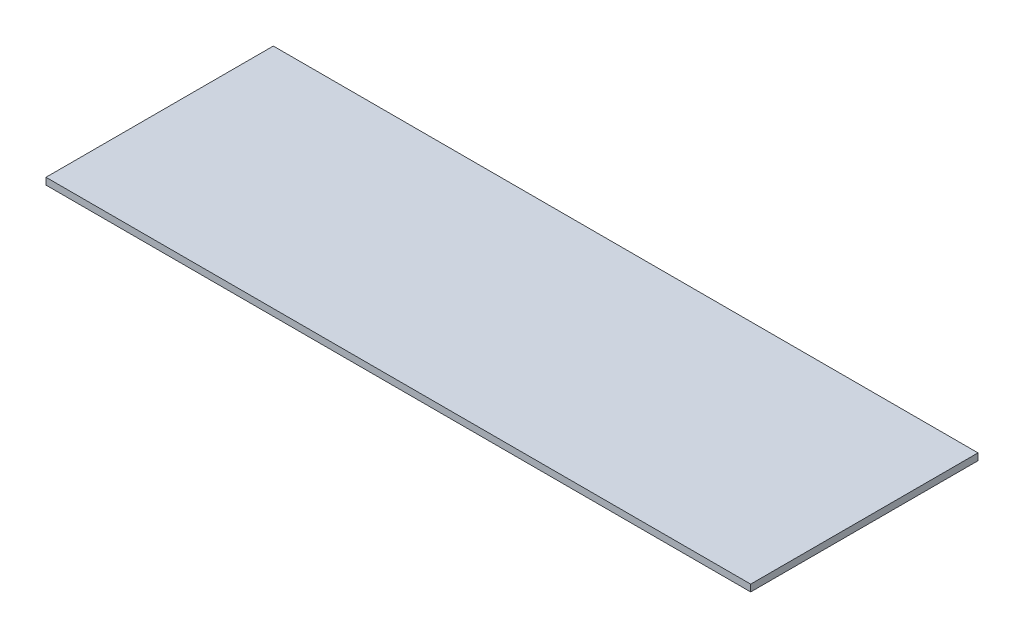
ISO-10303-21;
HEADER;
FILE_DESCRIPTION(('STEP AP214'),'2;1');
FILE_NAME('part.step','',(''),(''),'','','');
FILE_SCHEMA(('AUTOMOTIVE_DESIGN { 1 0 10303 214 1 1 1 1 }'));
ENDSEC;
DATA;
#1=APPLICATION_CONTEXT('core data for automotive mechanical design processes');
#2=APPLICATION_PROTOCOL_DEFINITION('international standard','automotive_design',2000,#1);
#3=PRODUCT_CONTEXT('',#1,'mechanical');
#4=PRODUCT('Part','Part','',(#3));
#5=PRODUCT_RELATED_PRODUCT_CATEGORY('part','',(#4));
#6=PRODUCT_DEFINITION_FORMATION('','',#4);
#7=PRODUCT_DEFINITION_CONTEXT('part definition',#1,'design');
#8=PRODUCT_DEFINITION('design','',#6,#7);
#9=PRODUCT_DEFINITION_SHAPE('','',#8);
#10=(LENGTH_UNIT() NAMED_UNIT(*) SI_UNIT(.MILLI.,.METRE.));
#11=(NAMED_UNIT(*) PLANE_ANGLE_UNIT() SI_UNIT($,.RADIAN.));
#12=(NAMED_UNIT(*) SI_UNIT($,.STERADIAN.) SOLID_ANGLE_UNIT());
#13=UNCERTAINTY_MEASURE_WITH_UNIT(LENGTH_MEASURE(1.E-05),#10,'distance_accuracy_value','');
#14=(GEOMETRIC_REPRESENTATION_CONTEXT(3) GLOBAL_UNCERTAINTY_ASSIGNED_CONTEXT((#13)) GLOBAL_UNIT_ASSIGNED_CONTEXT((#10,
#11,#12)) REPRESENTATION_CONTEXT('',''));
#15=CARTESIAN_POINT('',(0.,0.,0.));
#16=DIRECTION('',(0.,0.,1.));
#17=DIRECTION('',(1.,0.,0.));
#18=AXIS2_PLACEMENT_3D('',#15,#16,#17);
#19=CARTESIAN_POINT('',(-155.,3.,50.));
#20=DIRECTION('',(1.,0.,0.));
#21=DIRECTION('',(0.,0.,-1.));
#22=AXIS2_PLACEMENT_3D('',#19,#20,#21);
#23=PLANE('',#22);
#24=DIRECTION('',(0.,0.,1.));
#25=VECTOR('',#24,1.);
#26=CARTESIAN_POINT('',(-155.,0.,50.));
#27=LINE('',#26,#25);
#28=CARTESIAN_POINT('',(-155.,0.,-50.));
#29=VERTEX_POINT('',#28);
#30=CARTESIAN_POINT('',(-155.,0.,50.));
#31=VERTEX_POINT('',#30);
#32=EDGE_CURVE('E96',#29,#31,#27,.T.);
#33=ORIENTED_EDGE('',*,*,#32,.T.);
#34=DIRECTION('',(0.,-1.,0.));
#35=VECTOR('',#34,1.);
#36=CARTESIAN_POINT('',(-155.,3.,50.));
#37=LINE('',#36,#35);
#38=CARTESIAN_POINT('',(-155.,3.,50.));
#39=VERTEX_POINT('',#38);
#40=EDGE_CURVE('E11',#39,#31,#37,.T.);
#41=ORIENTED_EDGE('',*,*,#40,.F.);
#42=DIRECTION('',(0.,0.,1.));
#43=VECTOR('',#42,1.);
#44=CARTESIAN_POINT('',(-155.,3.,50.));
#45=LINE('',#44,#43);
#46=CARTESIAN_POINT('',(-155.,3.,-50.));
#47=VERTEX_POINT('',#46);
#48=EDGE_CURVE('E84',#47,#39,#45,.T.);
#49=ORIENTED_EDGE('',*,*,#48,.F.);
#50=DIRECTION('',(0.,-1.,0.));
#51=VECTOR('',#50,1.);
#52=CARTESIAN_POINT('',(-155.,3.,-50.));
#53=LINE('',#52,#51);
#54=EDGE_CURVE('E92',#47,#29,#53,.T.);
#55=ORIENTED_EDGE('',*,*,#54,.T.);
#56=EDGE_LOOP('',(#33,#41,#49,#55));
#57=FACE_BOUND('',#56,.T.);
#58=ADVANCED_FACE('F33',(#57),#23,.F.);
#59=CARTESIAN_POINT('',(155.,3.,50.));
#60=DIRECTION('',(0.,0.,-1.));
#61=DIRECTION('',(-1.,0.,0.));
#62=AXIS2_PLACEMENT_3D('',#59,#60,#61);
#63=PLANE('',#62);
#64=DIRECTION('',(1.,0.,0.));
#65=VECTOR('',#64,1.);
#66=CARTESIAN_POINT('',(155.,0.,50.));
#67=LINE('',#66,#65);
#68=CARTESIAN_POINT('',(155.,0.,50.));
#69=VERTEX_POINT('',#68);
#70=EDGE_CURVE('E88',#31,#69,#67,.T.);
#71=ORIENTED_EDGE('',*,*,#70,.T.);
#72=DIRECTION('',(0.,-1.,0.));
#73=VECTOR('',#72,1.);
#74=CARTESIAN_POINT('',(155.,3.,50.));
#75=LINE('',#74,#73);
#76=CARTESIAN_POINT('',(155.,3.,50.));
#77=VERTEX_POINT('',#76);
#78=EDGE_CURVE('E41',#77,#69,#75,.T.);
#79=ORIENTED_EDGE('',*,*,#78,.F.);
#80=DIRECTION('',(1.,0.,0.));
#81=VECTOR('',#80,1.);
#82=CARTESIAN_POINT('',(155.,3.,50.));
#83=LINE('',#82,#81);
#84=EDGE_CURVE('E79',#39,#77,#83,.T.);
#85=ORIENTED_EDGE('',*,*,#84,.F.);
#86=ORIENTED_EDGE('',*,*,#40,.T.);
#87=EDGE_LOOP('',(#71,#79,#85,#86));
#88=FACE_BOUND('',#87,.T.);
#89=ADVANCED_FACE('F87',(#88),#63,.F.);
#90=CARTESIAN_POINT('',(155.,3.,50.));
#91=DIRECTION('',(-1.,0.,0.));
#92=DIRECTION('',(0.,0.,1.));
#93=AXIS2_PLACEMENT_3D('',#90,#91,#92);
#94=PLANE('',#93);
#95=DIRECTION('',(0.,0.,-1.));
#96=VECTOR('',#95,1.);
#97=CARTESIAN_POINT('',(155.,0.,50.));
#98=LINE('',#97,#96);
#99=CARTESIAN_POINT('',(155.,0.,-50.));
#100=VERTEX_POINT('',#99);
#101=EDGE_CURVE('E66',#69,#100,#98,.T.);
#102=ORIENTED_EDGE('',*,*,#101,.T.);
#103=DIRECTION('',(0.,-1.,0.));
#104=VECTOR('',#103,1.);
#105=CARTESIAN_POINT('',(155.,3.,-50.));
#106=LINE('',#105,#104);
#107=CARTESIAN_POINT('',(155.,3.,-50.));
#108=VERTEX_POINT('',#107);
#109=EDGE_CURVE('E89',#108,#100,#106,.T.);
#110=ORIENTED_EDGE('',*,*,#109,.F.);
#111=DIRECTION('',(0.,0.,-1.));
#112=VECTOR('',#111,1.);
#113=CARTESIAN_POINT('',(155.,3.,50.));
#114=LINE('',#113,#112);
#115=EDGE_CURVE('E82',#77,#108,#114,.T.);
#116=ORIENTED_EDGE('',*,*,#115,.F.);
#117=ORIENTED_EDGE('',*,*,#78,.T.);
#118=EDGE_LOOP('',(#102,#110,#116,#117));
#119=FACE_BOUND('',#118,.T.);
#120=ADVANCED_FACE('F90',(#119),#94,.F.);
#121=CARTESIAN_POINT('',(155.,3.,-50.));
#122=DIRECTION('',(0.,0.,1.));
#123=DIRECTION('',(1.,0.,0.));
#124=AXIS2_PLACEMENT_3D('',#121,#122,#123);
#125=PLANE('',#124);
#126=DIRECTION('',(-1.,0.,0.));
#127=VECTOR('',#126,1.);
#128=CARTESIAN_POINT('',(155.,0.,-50.));
#129=LINE('',#128,#127);
#130=EDGE_CURVE('E72',#100,#29,#129,.T.);
#131=ORIENTED_EDGE('',*,*,#130,.T.);
#132=ORIENTED_EDGE('',*,*,#54,.F.);
#133=DIRECTION('',(-1.,0.,0.));
#134=VECTOR('',#133,1.);
#135=CARTESIAN_POINT('',(155.,3.,-50.));
#136=LINE('',#135,#134);
#137=EDGE_CURVE('E49',#108,#47,#136,.T.);
#138=ORIENTED_EDGE('',*,*,#137,.F.);
#139=ORIENTED_EDGE('',*,*,#109,.T.);
#140=EDGE_LOOP('',(#131,#132,#138,#139));
#141=FACE_BOUND('',#140,.T.);
#142=ADVANCED_FACE('F103',(#141),#125,.F.);
#143=CARTESIAN_POINT('',(0.,3.,0.));
#144=DIRECTION('',(0.,1.,0.));
#145=DIRECTION('',(0.,0.,1.));
#146=AXIS2_PLACEMENT_3D('',#143,#144,#145);
#147=PLANE('',#146);
#148=ORIENTED_EDGE('',*,*,#48,.T.);
#149=ORIENTED_EDGE('',*,*,#84,.T.);
#150=ORIENTED_EDGE('',*,*,#115,.T.);
#151=ORIENTED_EDGE('',*,*,#137,.T.);
#152=EDGE_LOOP('',(#148,#149,#150,#151));
#153=FACE_BOUND('',#152,.T.);
#154=ADVANCED_FACE('F80',(#153),#147,.T.);
#155=CARTESIAN_POINT('',(0.,0.,0.));
#156=DIRECTION('',(0.,1.,0.));
#157=DIRECTION('',(0.,0.,1.));
#158=AXIS2_PLACEMENT_3D('',#155,#156,#157);
#159=PLANE('',#158);
#160=ORIENTED_EDGE('',*,*,#32,.F.);
#161=ORIENTED_EDGE('',*,*,#130,.F.);
#162=ORIENTED_EDGE('',*,*,#101,.F.);
#163=ORIENTED_EDGE('',*,*,#70,.F.);
#164=EDGE_LOOP('',(#160,#161,#162,#163));
#165=FACE_BOUND('',#164,.T.);
#166=ADVANCED_FACE('F106',(#165),#159,.F.);
#167=CLOSED_SHELL('',(#58,#89,#120,#142,#154,#166));
#168=MANIFOLD_SOLID_BREP('B2',#167);
#169=ADVANCED_BREP_SHAPE_REPRESENTATION('',(#18,#168),#14);
#170=SHAPE_DEFINITION_REPRESENTATION(#9,#169);
ENDSEC;
END-ISO-10303-21;
